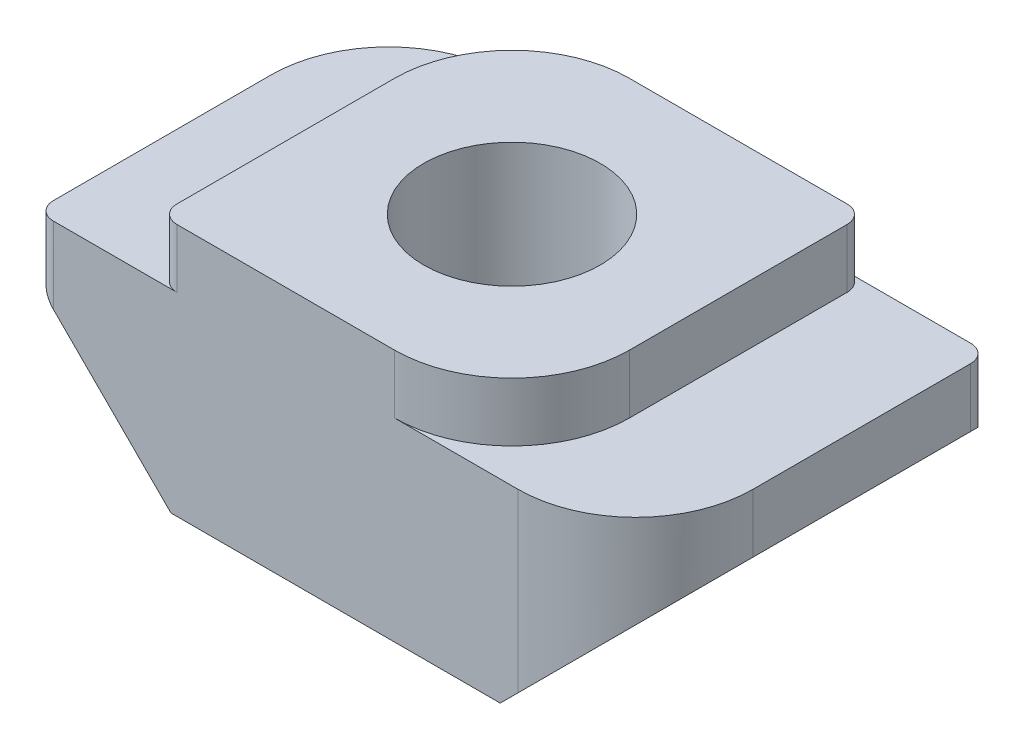
ISO-10303-21;
HEADER;
FILE_DESCRIPTION(('STEP AP214'),'2;1');
FILE_NAME('part.step','',(''),(''),'','','');
FILE_SCHEMA(('AUTOMOTIVE_DESIGN { 1 0 10303 214 1 1 1 1 }'));
ENDSEC;
DATA;
#1=APPLICATION_CONTEXT('core data for automotive mechanical design processes');
#2=APPLICATION_PROTOCOL_DEFINITION('international standard','automotive_design',2000,#1);
#3=PRODUCT_CONTEXT('',#1,'mechanical');
#4=PRODUCT('Part','Part','',(#3));
#5=PRODUCT_RELATED_PRODUCT_CATEGORY('part','',(#4));
#6=PRODUCT_DEFINITION_FORMATION('','',#4);
#7=PRODUCT_DEFINITION_CONTEXT('part definition',#1,'design');
#8=PRODUCT_DEFINITION('design','',#6,#7);
#9=PRODUCT_DEFINITION_SHAPE('','',#8);
#10=(LENGTH_UNIT() NAMED_UNIT(*) SI_UNIT(.MILLI.,.METRE.));
#11=(NAMED_UNIT(*) PLANE_ANGLE_UNIT() SI_UNIT($,.RADIAN.));
#12=(NAMED_UNIT(*) SI_UNIT($,.STERADIAN.) SOLID_ANGLE_UNIT());
#13=UNCERTAINTY_MEASURE_WITH_UNIT(LENGTH_MEASURE(1.E-05),#10,'distance_accuracy_value','');
#14=(GEOMETRIC_REPRESENTATION_CONTEXT(3) GLOBAL_UNCERTAINTY_ASSIGNED_CONTEXT((#13)) GLOBAL_UNIT_ASSIGNED_CONTEXT((#10,
#11,#12)) REPRESENTATION_CONTEXT('',''));
#15=CARTESIAN_POINT('',(0.,0.,0.));
#16=DIRECTION('',(0.,0.,1.));
#17=DIRECTION('',(1.,0.,0.));
#18=AXIS2_PLACEMENT_3D('',#15,#16,#17);
#19=CARTESIAN_POINT('',(3.,4.3,6.));
#20=DIRECTION('',(-1.,0.,0.));
#21=DIRECTION('',(0.,-1.,0.));
#22=AXIS2_PLACEMENT_3D('',#19,#20,#21);
#23=PLANE('',#22);
#24=DIRECTION('',(0.,0.,-1.));
#25=VECTOR('',#24,1.);
#26=CARTESIAN_POINT('',(3.,3.3,6.));
#27=LINE('',#26,#25);
#28=CARTESIAN_POINT('',(3.,3.3,4.));
#29=VERTEX_POINT('',#28);
#30=CARTESIAN_POINT('',(3.,3.3,0.3));
#31=VERTEX_POINT('',#30);
#32=EDGE_CURVE('E197',#29,#31,#27,.T.);
#33=ORIENTED_EDGE('',*,*,#32,.T.);
#34=DIRECTION('',(0.,1.,0.));
#35=VECTOR('',#34,1.);
#36=CARTESIAN_POINT('',(3.,4.3,0.3));
#37=LINE('',#36,#35);
#38=CARTESIAN_POINT('',(3.,4.3,0.3));
#39=VERTEX_POINT('',#38);
#40=EDGE_CURVE('E286',#31,#39,#37,.T.);
#41=ORIENTED_EDGE('',*,*,#40,.T.);
#42=DIRECTION('',(0.,0.,-1.));
#43=VECTOR('',#42,1.);
#44=CARTESIAN_POINT('',(3.,4.3,6.));
#45=LINE('',#44,#43);
#46=CARTESIAN_POINT('',(3.,4.3,4.));
#47=VERTEX_POINT('',#46);
#48=EDGE_CURVE('E226',#47,#39,#45,.T.);
#49=ORIENTED_EDGE('',*,*,#48,.F.);
#50=DIRECTION('',(0.,1.,0.));
#51=VECTOR('',#50,1.);
#52=CARTESIAN_POINT('',(3.,3.3,4.));
#53=LINE('',#52,#51);
#54=EDGE_CURVE('E237',#47,#29,#53,.F.);
#55=ORIENTED_EDGE('',*,*,#54,.T.);
#56=EDGE_LOOP('',(#33,#41,#49,#55));
#57=FACE_BOUND('',#56,.T.);
#58=ADVANCED_FACE('F36',(#57),#23,.F.);
#59=CARTESIAN_POINT('',(-3.,4.3,6.));
#60=DIRECTION('',(0.,-1.,0.));
#61=DIRECTION('',(0.,0.,-1.));
#62=AXIS2_PLACEMENT_3D('',#59,#60,#61);
#63=PLANE('',#62);
#64=CARTESIAN_POINT('',(0.,4.3,3.));
#65=DIRECTION('',(0.,1.,0.));
#66=DIRECTION('',(0.,0.,1.));
#67=AXIS2_PLACEMENT_3D('',#64,#65,#66);
#68=CIRCLE('',#67,1.5);
#69=CARTESIAN_POINT('',(0.,4.3,4.5));
#70=VERTEX_POINT('',#69);
#71=EDGE_CURVE('E320',#70,#70,#68,.T.);
#72=ORIENTED_EDGE('',*,*,#71,.F.);
#73=EDGE_LOOP('',(#72));
#74=FACE_BOUND('',#73,.T.);
#75=DIRECTION('',(0.,0.,-1.));
#76=VECTOR('',#75,1.);
#77=CARTESIAN_POINT('',(-3.,4.3,6.));
#78=LINE('',#77,#76);
#79=CARTESIAN_POINT('',(-3.,4.3,5.7));
#80=VERTEX_POINT('',#79);
#81=CARTESIAN_POINT('',(-3.,4.3,2.));
#82=VERTEX_POINT('',#81);
#83=EDGE_CURVE('E224',#80,#82,#78,.T.);
#84=ORIENTED_EDGE('',*,*,#83,.F.);
#85=CARTESIAN_POINT('',(-2.7,4.3,5.7));
#86=DIRECTION('',(0.,-1.,0.));
#87=DIRECTION('',(0.,0.,-1.));
#88=AXIS2_PLACEMENT_3D('',#85,#86,#87);
#89=CIRCLE('',#88,0.3);
#90=CARTESIAN_POINT('',(-2.7,4.3,6.));
#91=VERTEX_POINT('',#90);
#92=EDGE_CURVE('E284',#80,#91,#89,.F.);
#93=ORIENTED_EDGE('',*,*,#92,.T.);
#94=DIRECTION('',(-1.,0.,0.));
#95=VECTOR('',#94,1.);
#96=CARTESIAN_POINT('',(-3.,4.3,6.));
#97=LINE('',#96,#95);
#98=CARTESIAN_POINT('',(1.,4.3,6.));
#99=VERTEX_POINT('',#98);
#100=EDGE_CURVE('E210',#99,#91,#97,.T.);
#101=ORIENTED_EDGE('',*,*,#100,.F.);
#102=CARTESIAN_POINT('',(1.,4.3,4.));
#103=DIRECTION('',(0.,-1.,0.));
#104=DIRECTION('',(0.,0.,-1.));
#105=AXIS2_PLACEMENT_3D('',#102,#103,#104);
#106=CIRCLE('',#105,2.);
#107=EDGE_CURVE('E235',#99,#47,#106,.F.);
#108=ORIENTED_EDGE('',*,*,#107,.T.);
#109=ORIENTED_EDGE('',*,*,#48,.T.);
#110=CARTESIAN_POINT('',(2.7,4.3,0.3));
#111=DIRECTION('',(0.,-1.,0.));
#112=DIRECTION('',(0.,0.,-1.));
#113=AXIS2_PLACEMENT_3D('',#110,#111,#112);
#114=CIRCLE('',#113,0.3);
#115=CARTESIAN_POINT('',(2.7,4.3,0.));
#116=VERTEX_POINT('',#115);
#117=EDGE_CURVE('E282',#39,#116,#114,.F.);
#118=ORIENTED_EDGE('',*,*,#117,.T.);
#119=DIRECTION('',(-1.,0.,0.));
#120=VECTOR('',#119,1.);
#121=CARTESIAN_POINT('',(-3.,4.3,0.));
#122=LINE('',#121,#120);
#123=CARTESIAN_POINT('',(-1.,4.3,0.));
#124=VERTEX_POINT('',#123);
#125=EDGE_CURVE('E198',#116,#124,#122,.T.);
#126=ORIENTED_EDGE('',*,*,#125,.T.);
#127=CARTESIAN_POINT('',(-1.,4.3,2.));
#128=DIRECTION('',(0.,-1.,0.));
#129=DIRECTION('',(0.,0.,-1.));
#130=AXIS2_PLACEMENT_3D('',#127,#128,#129);
#131=CIRCLE('',#130,2.);
#132=EDGE_CURVE('E232',#124,#82,#131,.F.);
#133=ORIENTED_EDGE('',*,*,#132,.T.);
#134=EDGE_LOOP('',(#84,#93,#101,#108,#109,#118,#126,#133));
#135=FACE_BOUND('',#134,.T.);
#136=ADVANCED_FACE('F316',(#74,#135),#63,.F.);
#137=CARTESIAN_POINT('',(-3.,4.3,6.));
#138=DIRECTION('',(1.,0.,0.));
#139=DIRECTION('',(0.,1.,0.));
#140=AXIS2_PLACEMENT_3D('',#137,#138,#139);
#141=PLANE('',#140);
#142=DIRECTION('',(0.,0.,-1.));
#143=VECTOR('',#142,1.);
#144=CARTESIAN_POINT('',(-3.,3.3,6.));
#145=LINE('',#144,#143);
#146=CARTESIAN_POINT('',(-3.,3.3,5.7));
#147=VERTEX_POINT('',#146);
#148=CARTESIAN_POINT('',(-3.,3.3,2.));
#149=VERTEX_POINT('',#148);
#150=EDGE_CURVE('E222',#147,#149,#145,.T.);
#151=ORIENTED_EDGE('',*,*,#150,.F.);
#152=DIRECTION('',(0.,-1.,0.));
#153=VECTOR('',#152,1.);
#154=CARTESIAN_POINT('',(-3.,4.3,5.7));
#155=LINE('',#154,#153);
#156=EDGE_CURVE('E280',#147,#80,#155,.F.);
#157=ORIENTED_EDGE('',*,*,#156,.T.);
#158=ORIENTED_EDGE('',*,*,#83,.T.);
#159=DIRECTION('',(0.,-1.,0.));
#160=VECTOR('',#159,1.);
#161=CARTESIAN_POINT('',(-3.,4.3,2.));
#162=LINE('',#161,#160);
#163=EDGE_CURVE('E239',#82,#149,#162,.T.);
#164=ORIENTED_EDGE('',*,*,#163,.T.);
#165=EDGE_LOOP('',(#151,#157,#158,#164));
#166=FACE_BOUND('',#165,.T.);
#167=ADVANCED_FACE('F308',(#166),#141,.F.);
#168=CARTESIAN_POINT('',(-3.,3.3,6.));
#169=DIRECTION('',(0.,-1.,0.));
#170=DIRECTION('',(0.,0.,-1.));
#171=AXIS2_PLACEMENT_3D('',#168,#169,#170);
#172=PLANE('',#171);
#173=DIRECTION('',(0.,0.,-1.));
#174=VECTOR('',#173,1.);
#175=CARTESIAN_POINT('',(-5.1,3.3,6.));
#176=LINE('',#175,#174);
#177=CARTESIAN_POINT('',(-5.1,3.3,5.7));
#178=VERTEX_POINT('',#177);
#179=CARTESIAN_POINT('',(-5.1,3.3,2.));
#180=VERTEX_POINT('',#179);
#181=EDGE_CURVE('E220',#178,#180,#176,.T.);
#182=ORIENTED_EDGE('',*,*,#181,.F.);
#183=CARTESIAN_POINT('',(-4.8,3.3,5.7));
#184=DIRECTION('',(0.,-1.,0.));
#185=DIRECTION('',(0.,0.,-1.));
#186=AXIS2_PLACEMENT_3D('',#183,#184,#185);
#187=CIRCLE('',#186,0.3);
#188=CARTESIAN_POINT('',(-4.8,3.3,6.));
#189=VERTEX_POINT('',#188);
#190=EDGE_CURVE('E278',#178,#189,#187,.F.);
#191=ORIENTED_EDGE('',*,*,#190,.T.);
#192=DIRECTION('',(-1.,0.,0.));
#193=VECTOR('',#192,1.);
#194=CARTESIAN_POINT('',(-3.,3.3,6.));
#195=LINE('',#194,#193);
#196=CARTESIAN_POINT('',(-2.7,3.3,6.));
#197=VERTEX_POINT('',#196);
#198=EDGE_CURVE('E175',#197,#189,#195,.T.);
#199=ORIENTED_EDGE('',*,*,#198,.F.);
#200=CARTESIAN_POINT('',(-2.7,3.3,5.7));
#201=DIRECTION('',(0.,-1.,0.));
#202=DIRECTION('',(0.,0.,-1.));
#203=AXIS2_PLACEMENT_3D('',#200,#201,#202);
#204=CIRCLE('',#203,0.3);
#205=EDGE_CURVE('E45',#197,#147,#204,.T.);
#206=ORIENTED_EDGE('',*,*,#205,.T.);
#207=ORIENTED_EDGE('',*,*,#150,.T.);
#208=CARTESIAN_POINT('',(-1.,3.3,2.));
#209=DIRECTION('',(0.,-1.,0.));
#210=DIRECTION('',(0.,0.,-1.));
#211=AXIS2_PLACEMENT_3D('',#208,#209,#210);
#212=CIRCLE('',#211,2.);
#213=CARTESIAN_POINT('',(-1.,3.3,0.));
#214=VERTEX_POINT('',#213);
#215=EDGE_CURVE('E248',#149,#214,#212,.T.);
#216=ORIENTED_EDGE('',*,*,#215,.T.);
#217=DIRECTION('',(-1.,0.,0.));
#218=VECTOR('',#217,1.);
#219=CARTESIAN_POINT('',(-3.,3.3,0.));
#220=LINE('',#219,#218);
#221=CARTESIAN_POINT('',(-3.1,3.3,0.));
#222=VERTEX_POINT('',#221);
#223=EDGE_CURVE('E200',#214,#222,#220,.T.);
#224=ORIENTED_EDGE('',*,*,#223,.T.);
#225=CARTESIAN_POINT('',(-3.1,3.3,2.));
#226=DIRECTION('',(0.,-1.,0.));
#227=DIRECTION('',(0.,0.,-1.));
#228=AXIS2_PLACEMENT_3D('',#225,#226,#227);
#229=CIRCLE('',#228,2.);
#230=EDGE_CURVE('E267',#222,#180,#229,.F.);
#231=ORIENTED_EDGE('',*,*,#230,.T.);
#232=EDGE_LOOP('',(#182,#191,#199,#206,#207,#216,#224,#231));
#233=FACE_BOUND('',#232,.T.);
#234=ADVANCED_FACE('F302',(#233),#172,.F.);
#235=CARTESIAN_POINT('',(-5.1,3.3,6.));
#236=DIRECTION('',(1.,0.,0.));
#237=DIRECTION('',(0.,0.,-1.));
#238=AXIS2_PLACEMENT_3D('',#235,#236,#237);
#239=PLANE('',#238);
#240=DIRECTION('',(0.,0.,-1.));
#241=VECTOR('',#240,1.);
#242=CARTESIAN_POINT('',(-5.1,2.3,6.));
#243=LINE('',#242,#241);
#244=CARTESIAN_POINT('',(-5.1,2.3,5.7));
#245=VERTEX_POINT('',#244);
#246=CARTESIAN_POINT('',(-5.1,2.3,2.));
#247=VERTEX_POINT('',#246);
#248=EDGE_CURVE('E184',#245,#247,#243,.T.);
#249=ORIENTED_EDGE('',*,*,#248,.F.);
#250=DIRECTION('',(0.,-1.,0.));
#251=VECTOR('',#250,1.);
#252=CARTESIAN_POINT('',(-5.1,3.3,5.7));
#253=LINE('',#252,#251);
#254=EDGE_CURVE('E276',#245,#178,#253,.F.);
#255=ORIENTED_EDGE('',*,*,#254,.T.);
#256=ORIENTED_EDGE('',*,*,#181,.T.);
#257=DIRECTION('',(0.,-1.,0.));
#258=VECTOR('',#257,1.);
#259=CARTESIAN_POINT('',(-5.1,3.3,2.));
#260=LINE('',#259,#258);
#261=EDGE_CURVE('E260',#180,#247,#260,.T.);
#262=ORIENTED_EDGE('',*,*,#261,.T.);
#263=EDGE_LOOP('',(#249,#255,#256,#262));
#264=FACE_BOUND('',#263,.T.);
#265=ADVANCED_FACE('F401',(#264),#239,.F.);
#266=CARTESIAN_POINT('',(-5.1,2.3,6.));
#267=DIRECTION('',(0.707106781186551,0.707106781186544,0.));
#268=DIRECTION('',(-0.707106781186544,0.707106781186551,0.));
#269=AXIS2_PLACEMENT_3D('',#266,#267,#268);
#270=PLANE('',#269);
#271=DIRECTION('',(0.707106781186544,-0.707106781186551,0.));
#272=VECTOR('',#271,1.);
#273=CARTESIAN_POINT('',(-5.1,2.3,6.));
#274=LINE('',#273,#272);
#275=CARTESIAN_POINT('',(-4.8,2.,6.));
#276=VERTEX_POINT('',#275);
#277=CARTESIAN_POINT('',(-2.80000000000002,0.,6.));
#278=VERTEX_POINT('',#277);
#279=EDGE_CURVE('E164',#276,#278,#274,.T.);
#280=ORIENTED_EDGE('',*,*,#279,.F.);
#281=CARTESIAN_POINT('',(-4.8,2.,5.7));
#282=DIRECTION('',(0.707106781186551,0.707106781186544,0.));
#283=DIRECTION('',(-0.707106781186544,0.707106781186551,0.));
#284=AXIS2_PLACEMENT_3D('',#281,#282,#283);
#285=ELLIPSE('',#284,0.424264068711931,0.3);
#286=EDGE_CURVE('E274',#276,#245,#285,.F.);
#287=ORIENTED_EDGE('',*,*,#286,.T.);
#288=ORIENTED_EDGE('',*,*,#248,.T.);
#289=CARTESIAN_POINT('',(-3.1,0.299999999999978,2.));
#290=DIRECTION('',(0.707106781186551,0.707106781186544,0.));
#291=DIRECTION('',(0.707106781186544,-0.707106781186551,0.));
#292=AXIS2_PLACEMENT_3D('',#289,#290,#291);
#293=ELLIPSE('',#292,2.82842712474621,2.);
#294=CARTESIAN_POINT('',(-3.1,0.299999999999978,0.));
#295=VERTEX_POINT('',#294);
#296=EDGE_CURVE('E263',#247,#295,#293,.F.);
#297=ORIENTED_EDGE('',*,*,#296,.T.);
#298=DIRECTION('',(0.707106781186544,-0.707106781186551,0.));
#299=VECTOR('',#298,1.);
#300=CARTESIAN_POINT('',(-5.1,2.3,0.));
#301=LINE('',#300,#299);
#302=CARTESIAN_POINT('',(-2.80000000000002,0.,0.));
#303=VERTEX_POINT('',#302);
#304=EDGE_CURVE('E181',#295,#303,#301,.T.);
#305=ORIENTED_EDGE('',*,*,#304,.T.);
#306=DIRECTION('',(0.,0.,-1.));
#307=VECTOR('',#306,1.);
#308=CARTESIAN_POINT('',(-2.80000000000002,0.,6.));
#309=LINE('',#308,#307);
#310=EDGE_CURVE('E178',#278,#303,#309,.T.);
#311=ORIENTED_EDGE('',*,*,#310,.F.);
#312=EDGE_LOOP('',(#280,#287,#288,#297,#305,#311));
#313=FACE_BOUND('',#312,.T.);
#314=ADVANCED_FACE('F179',(#313),#270,.F.);
#315=CARTESIAN_POINT('',(2.80000000000002,0.,6.));
#316=DIRECTION('',(0.,1.,0.));
#317=DIRECTION('',(0.,0.,1.));
#318=AXIS2_PLACEMENT_3D('',#315,#316,#317);
#319=PLANE('',#318);
#320=CARTESIAN_POINT('',(0.,0.,3.));
#321=DIRECTION('',(0.,1.,0.));
#322=DIRECTION('',(0.,0.,1.));
#323=AXIS2_PLACEMENT_3D('',#320,#321,#322);
#324=CIRCLE('',#323,1.5);
#325=CARTESIAN_POINT('',(0.,0.,4.5));
#326=VERTEX_POINT('',#325);
#327=EDGE_CURVE('E40',#326,#326,#324,.T.);
#328=ORIENTED_EDGE('',*,*,#327,.T.);
#329=EDGE_LOOP('',(#328));
#330=FACE_BOUND('',#329,.T.);
#331=DIRECTION('',(1.,0.,0.));
#332=VECTOR('',#331,1.);
#333=CARTESIAN_POINT('',(2.80000000000002,0.,0.));
#334=LINE('',#333,#332);
#335=CARTESIAN_POINT('',(2.80000000000002,0.,0.));
#336=VERTEX_POINT('',#335);
#337=EDGE_CURVE('E204',#303,#336,#334,.T.);
#338=ORIENTED_EDGE('',*,*,#337,.T.);
#339=DIRECTION('',(0.,0.,-1.));
#340=VECTOR('',#339,1.);
#341=CARTESIAN_POINT('',(2.80000000000002,0.,6.));
#342=LINE('',#341,#340);
#343=CARTESIAN_POINT('',(2.80000000000002,0.,6.));
#344=VERTEX_POINT('',#343);
#345=EDGE_CURVE('E185',#344,#336,#342,.T.);
#346=ORIENTED_EDGE('',*,*,#345,.F.);
#347=DIRECTION('',(1.,0.,0.));
#348=VECTOR('',#347,1.);
#349=CARTESIAN_POINT('',(2.80000000000002,0.,6.));
#350=LINE('',#349,#348);
#351=EDGE_CURVE('E170',#278,#344,#350,.T.);
#352=ORIENTED_EDGE('',*,*,#351,.F.);
#353=ORIENTED_EDGE('',*,*,#310,.T.);
#354=EDGE_LOOP('',(#338,#346,#352,#353));
#355=FACE_BOUND('',#354,.T.);
#356=ADVANCED_FACE('F187',(#330,#355),#319,.F.);
#357=CARTESIAN_POINT('',(5.1,2.3,6.));
#358=DIRECTION('',(-0.707106781186551,0.707106781186544,0.));
#359=DIRECTION('',(-0.707106781186544,-0.707106781186551,0.));
#360=AXIS2_PLACEMENT_3D('',#357,#358,#359);
#361=PLANE('',#360);
#362=DIRECTION('',(0.707106781186544,0.707106781186551,0.));
#363=VECTOR('',#362,1.);
#364=CARTESIAN_POINT('',(5.1,2.3,0.));
#365=LINE('',#364,#363);
#366=CARTESIAN_POINT('',(4.8,2.,0.));
#367=VERTEX_POINT('',#366);
#368=EDGE_CURVE('E206',#336,#367,#365,.T.);
#369=ORIENTED_EDGE('',*,*,#368,.T.);
#370=CARTESIAN_POINT('',(4.8,2.,0.3));
#371=DIRECTION('',(-0.707106781186551,0.707106781186544,0.));
#372=DIRECTION('',(0.707106781186544,0.707106781186551,0.));
#373=AXIS2_PLACEMENT_3D('',#370,#371,#372);
#374=ELLIPSE('',#373,0.424264068711931,0.3);
#375=CARTESIAN_POINT('',(5.1,2.3,0.3));
#376=VERTEX_POINT('',#375);
#377=EDGE_CURVE('E52',#367,#376,#374,.F.);
#378=ORIENTED_EDGE('',*,*,#377,.T.);
#379=DIRECTION('',(0.,0.,-1.));
#380=VECTOR('',#379,1.);
#381=CARTESIAN_POINT('',(5.1,2.3,6.));
#382=LINE('',#381,#380);
#383=CARTESIAN_POINT('',(5.1,2.3,4.));
#384=VERTEX_POINT('',#383);
#385=EDGE_CURVE('E216',#384,#376,#382,.T.);
#386=ORIENTED_EDGE('',*,*,#385,.F.);
#387=CARTESIAN_POINT('',(3.1,0.299999999999978,4.));
#388=DIRECTION('',(-0.707106781186551,0.707106781186544,0.));
#389=DIRECTION('',(-0.707106781186544,-0.707106781186551,0.));
#390=AXIS2_PLACEMENT_3D('',#387,#388,#389);
#391=ELLIPSE('',#390,2.82842712474621,2.);
#392=CARTESIAN_POINT('',(3.1,0.299999999999978,6.));
#393=VERTEX_POINT('',#392);
#394=EDGE_CURVE('E258',#384,#393,#391,.F.);
#395=ORIENTED_EDGE('',*,*,#394,.T.);
#396=DIRECTION('',(0.707106781186544,0.707106781186551,0.));
#397=VECTOR('',#396,1.);
#398=CARTESIAN_POINT('',(5.1,2.3,6.));
#399=LINE('',#398,#397);
#400=EDGE_CURVE('E190',#344,#393,#399,.T.);
#401=ORIENTED_EDGE('',*,*,#400,.F.);
#402=ORIENTED_EDGE('',*,*,#345,.T.);
#403=EDGE_LOOP('',(#369,#378,#386,#395,#401,#402));
#404=FACE_BOUND('',#403,.T.);
#405=ADVANCED_FACE('F389',(#404),#361,.F.);
#406=CARTESIAN_POINT('',(5.1,3.3,6.));
#407=DIRECTION('',(-1.,0.,0.));
#408=DIRECTION('',(0.,0.,1.));
#409=AXIS2_PLACEMENT_3D('',#406,#407,#408);
#410=PLANE('',#409);
#411=ORIENTED_EDGE('',*,*,#385,.T.);
#412=DIRECTION('',(0.,1.,0.));
#413=VECTOR('',#412,1.);
#414=CARTESIAN_POINT('',(5.1,3.3,0.3));
#415=LINE('',#414,#413);
#416=CARTESIAN_POINT('',(5.1,3.3,0.3));
#417=VERTEX_POINT('',#416);
#418=EDGE_CURVE('E294',#376,#417,#415,.T.);
#419=ORIENTED_EDGE('',*,*,#418,.T.);
#420=DIRECTION('',(0.,0.,-1.));
#421=VECTOR('',#420,1.);
#422=CARTESIAN_POINT('',(5.1,3.3,6.));
#423=LINE('',#422,#421);
#424=CARTESIAN_POINT('',(5.1,3.3,4.));
#425=VERTEX_POINT('',#424);
#426=EDGE_CURVE('E213',#425,#417,#423,.T.);
#427=ORIENTED_EDGE('',*,*,#426,.F.);
#428=DIRECTION('',(0.,1.,0.));
#429=VECTOR('',#428,1.);
#430=CARTESIAN_POINT('',(5.1,2.3,4.));
#431=LINE('',#430,#429);
#432=EDGE_CURVE('E256',#425,#384,#431,.F.);
#433=ORIENTED_EDGE('',*,*,#432,.T.);
#434=EDGE_LOOP('',(#411,#419,#427,#433));
#435=FACE_BOUND('',#434,.T.);
#436=ADVANCED_FACE('F388',(#435),#410,.F.);
#437=CARTESIAN_POINT('',(3.,3.3,6.));
#438=DIRECTION('',(0.,-1.,0.));
#439=DIRECTION('',(0.,0.,-1.));
#440=AXIS2_PLACEMENT_3D('',#437,#438,#439);
#441=PLANE('',#440);
#442=ORIENTED_EDGE('',*,*,#426,.T.);
#443=CARTESIAN_POINT('',(4.8,3.3,0.3));
#444=DIRECTION('',(0.,-1.,0.));
#445=DIRECTION('',(0.,0.,-1.));
#446=AXIS2_PLACEMENT_3D('',#443,#444,#445);
#447=CIRCLE('',#446,0.3);
#448=CARTESIAN_POINT('',(4.8,3.3,0.));
#449=VERTEX_POINT('',#448);
#450=EDGE_CURVE('E60',#417,#449,#447,.F.);
#451=ORIENTED_EDGE('',*,*,#450,.T.);
#452=DIRECTION('',(-1.,0.,0.));
#453=VECTOR('',#452,1.);
#454=CARTESIAN_POINT('',(3.,3.3,0.));
#455=LINE('',#454,#453);
#456=CARTESIAN_POINT('',(2.7,3.3,0.));
#457=VERTEX_POINT('',#456);
#458=EDGE_CURVE('E208',#449,#457,#455,.T.);
#459=ORIENTED_EDGE('',*,*,#458,.T.);
#460=CARTESIAN_POINT('',(2.7,3.3,0.3));
#461=DIRECTION('',(0.,-1.,0.));
#462=DIRECTION('',(0.,0.,-1.));
#463=AXIS2_PLACEMENT_3D('',#460,#461,#462);
#464=CIRCLE('',#463,0.3);
#465=EDGE_CURVE('E11',#457,#31,#464,.T.);
#466=ORIENTED_EDGE('',*,*,#465,.T.);
#467=ORIENTED_EDGE('',*,*,#32,.F.);
#468=CARTESIAN_POINT('',(1.,3.3,4.));
#469=DIRECTION('',(0.,-1.,0.));
#470=DIRECTION('',(0.,0.,-1.));
#471=AXIS2_PLACEMENT_3D('',#468,#469,#470);
#472=CIRCLE('',#471,2.);
#473=CARTESIAN_POINT('',(1.,3.3,6.));
#474=VERTEX_POINT('',#473);
#475=EDGE_CURVE('E245',#29,#474,#472,.T.);
#476=ORIENTED_EDGE('',*,*,#475,.T.);
#477=DIRECTION('',(-1.,0.,0.));
#478=VECTOR('',#477,1.);
#479=CARTESIAN_POINT('',(3.,3.3,6.));
#480=LINE('',#479,#478);
#481=CARTESIAN_POINT('',(3.1,3.3,6.));
#482=VERTEX_POINT('',#481);
#483=EDGE_CURVE('E192',#482,#474,#480,.T.);
#484=ORIENTED_EDGE('',*,*,#483,.F.);
#485=CARTESIAN_POINT('',(3.1,3.3,4.));
#486=DIRECTION('',(0.,-1.,0.));
#487=DIRECTION('',(0.,0.,-1.));
#488=AXIS2_PLACEMENT_3D('',#485,#486,#487);
#489=CIRCLE('',#488,2.);
#490=EDGE_CURVE('E254',#482,#425,#489,.F.);
#491=ORIENTED_EDGE('',*,*,#490,.T.);
#492=EDGE_LOOP('',(#442,#451,#459,#466,#467,#476,#484,#491));
#493=FACE_BOUND('',#492,.T.);
#494=ADVANCED_FACE('F377',(#493),#441,.F.);
#495=CARTESIAN_POINT('',(0.,0.,6.));
#496=DIRECTION('',(0.,0.,1.));
#497=DIRECTION('',(1.,0.,0.));
#498=AXIS2_PLACEMENT_3D('',#495,#496,#497);
#499=PLANE('',#498);
#500=ORIENTED_EDGE('',*,*,#198,.T.);
#501=DIRECTION('',(0.,-1.,0.));
#502=VECTOR('',#501,1.);
#503=CARTESIAN_POINT('',(-4.8,2.3,6.));
#504=LINE('',#503,#502);
#505=EDGE_CURVE('E173',#189,#276,#504,.T.);
#506=ORIENTED_EDGE('',*,*,#505,.T.);
#507=ORIENTED_EDGE('',*,*,#279,.T.);
#508=ORIENTED_EDGE('',*,*,#351,.T.);
#509=ORIENTED_EDGE('',*,*,#400,.T.);
#510=DIRECTION('',(0.,1.,0.));
#511=VECTOR('',#510,1.);
#512=CARTESIAN_POINT('',(3.1,3.3,6.));
#513=LINE('',#512,#511);
#514=EDGE_CURVE('E251',#393,#482,#513,.T.);
#515=ORIENTED_EDGE('',*,*,#514,.T.);
#516=ORIENTED_EDGE('',*,*,#483,.T.);
#517=DIRECTION('',(0.,1.,0.));
#518=VECTOR('',#517,1.);
#519=CARTESIAN_POINT('',(1.,4.3,6.));
#520=LINE('',#519,#518);
#521=EDGE_CURVE('E229',#474,#99,#520,.T.);
#522=ORIENTED_EDGE('',*,*,#521,.T.);
#523=ORIENTED_EDGE('',*,*,#100,.T.);
#524=DIRECTION('',(0.,-1.,0.));
#525=VECTOR('',#524,1.);
#526=CARTESIAN_POINT('',(-2.7,3.3,6.));
#527=LINE('',#526,#525);
#528=EDGE_CURVE('E270',#91,#197,#527,.T.);
#529=ORIENTED_EDGE('',*,*,#528,.T.);
#530=EDGE_LOOP('',(#500,#506,#507,#508,#509,#515,#516,#522,#523,#529));
#531=FACE_BOUND('',#530,.T.);
#532=ADVANCED_FACE('F167',(#531),#499,.T.);
#533=CARTESIAN_POINT('',(0.,0.,0.));
#534=DIRECTION('',(0.,0.,1.));
#535=DIRECTION('',(1.,0.,0.));
#536=AXIS2_PLACEMENT_3D('',#533,#534,#535);
#537=PLANE('',#536);
#538=ORIENTED_EDGE('',*,*,#125,.F.);
#539=DIRECTION('',(0.,1.,0.));
#540=VECTOR('',#539,1.);
#541=CARTESIAN_POINT('',(2.7,0.,0.));
#542=LINE('',#541,#540);
#543=EDGE_CURVE('E291',#116,#457,#542,.F.);
#544=ORIENTED_EDGE('',*,*,#543,.T.);
#545=ORIENTED_EDGE('',*,*,#458,.F.);
#546=DIRECTION('',(0.,1.,0.));
#547=VECTOR('',#546,1.);
#548=CARTESIAN_POINT('',(4.8,0.,0.));
#549=LINE('',#548,#547);
#550=EDGE_CURVE('E289',#449,#367,#549,.F.);
#551=ORIENTED_EDGE('',*,*,#550,.T.);
#552=ORIENTED_EDGE('',*,*,#368,.F.);
#553=ORIENTED_EDGE('',*,*,#337,.F.);
#554=ORIENTED_EDGE('',*,*,#304,.F.);
#555=DIRECTION('',(0.,-1.,0.));
#556=VECTOR('',#555,1.);
#557=CARTESIAN_POINT('',(-3.1,0.,0.));
#558=LINE('',#557,#556);
#559=EDGE_CURVE('E265',#295,#222,#558,.F.);
#560=ORIENTED_EDGE('',*,*,#559,.T.);
#561=ORIENTED_EDGE('',*,*,#223,.F.);
#562=DIRECTION('',(0.,-1.,0.));
#563=VECTOR('',#562,1.);
#564=CARTESIAN_POINT('',(-1.,0.,0.));
#565=LINE('',#564,#563);
#566=EDGE_CURVE('E242',#214,#124,#565,.F.);
#567=ORIENTED_EDGE('',*,*,#566,.T.);
#568=EDGE_LOOP('',(#538,#544,#545,#551,#552,#553,#554,#560,#561,#567));
#569=FACE_BOUND('',#568,.T.);
#570=ADVANCED_FACE('F350',(#569),#537,.F.);
#571=CARTESIAN_POINT('',(1.,0.,4.));
#572=DIRECTION('',(0.,-1.,0.));
#573=DIRECTION('',(1.,0.,0.));
#574=AXIS2_PLACEMENT_3D('',#571,#572,#573);
#575=CYLINDRICAL_SURFACE('',#574,2.);
#576=ORIENTED_EDGE('',*,*,#475,.F.);
#577=ORIENTED_EDGE('',*,*,#54,.F.);
#578=ORIENTED_EDGE('',*,*,#107,.F.);
#579=ORIENTED_EDGE('',*,*,#521,.F.);
#580=EDGE_LOOP('',(#576,#577,#578,#579));
#581=FACE_BOUND('',#580,.T.);
#582=ADVANCED_FACE('F346',(#581),#575,.T.);
#583=CARTESIAN_POINT('',(-1.,4.3,2.));
#584=DIRECTION('',(0.,-1.,0.));
#585=DIRECTION('',(1.,0.,0.));
#586=AXIS2_PLACEMENT_3D('',#583,#584,#585);
#587=CYLINDRICAL_SURFACE('',#586,2.);
#588=ORIENTED_EDGE('',*,*,#132,.F.);
#589=ORIENTED_EDGE('',*,*,#566,.F.);
#590=ORIENTED_EDGE('',*,*,#215,.F.);
#591=ORIENTED_EDGE('',*,*,#163,.F.);
#592=EDGE_LOOP('',(#588,#589,#590,#591));
#593=FACE_BOUND('',#592,.T.);
#594=ADVANCED_FACE('F349',(#593),#587,.T.);
#595=CARTESIAN_POINT('',(3.1,0.,4.));
#596=DIRECTION('',(0.,-1.,0.));
#597=DIRECTION('',(0.,0.,-1.));
#598=AXIS2_PLACEMENT_3D('',#595,#596,#597);
#599=CYLINDRICAL_SURFACE('',#598,2.);
#600=ORIENTED_EDGE('',*,*,#394,.F.);
#601=ORIENTED_EDGE('',*,*,#432,.F.);
#602=ORIENTED_EDGE('',*,*,#490,.F.);
#603=ORIENTED_EDGE('',*,*,#514,.F.);
#604=EDGE_LOOP('',(#600,#601,#602,#603));
#605=FACE_BOUND('',#604,.T.);
#606=ADVANCED_FACE('F354',(#605),#599,.T.);
#607=CARTESIAN_POINT('',(-3.1,3.3,2.));
#608=DIRECTION('',(0.,-1.,0.));
#609=DIRECTION('',(0.,0.,-1.));
#610=AXIS2_PLACEMENT_3D('',#607,#608,#609);
#611=CYLINDRICAL_SURFACE('',#610,2.);
#612=ORIENTED_EDGE('',*,*,#230,.F.);
#613=ORIENTED_EDGE('',*,*,#559,.F.);
#614=ORIENTED_EDGE('',*,*,#296,.F.);
#615=ORIENTED_EDGE('',*,*,#261,.F.);
#616=EDGE_LOOP('',(#612,#613,#614,#615));
#617=FACE_BOUND('',#616,.T.);
#618=ADVANCED_FACE('F358',(#617),#611,.T.);
#619=CARTESIAN_POINT('',(-4.8,0.,5.7));
#620=DIRECTION('',(0.,1.,0.));
#621=DIRECTION('',(0.,0.,1.));
#622=AXIS2_PLACEMENT_3D('',#619,#620,#621);
#623=CYLINDRICAL_SURFACE('',#622,0.3);
#624=ORIENTED_EDGE('',*,*,#190,.F.);
#625=ORIENTED_EDGE('',*,*,#254,.F.);
#626=ORIENTED_EDGE('',*,*,#286,.F.);
#627=ORIENTED_EDGE('',*,*,#505,.F.);
#628=EDGE_LOOP('',(#624,#625,#626,#627));
#629=FACE_BOUND('',#628,.T.);
#630=ADVANCED_FACE('F362',(#629),#623,.T.);
#631=CARTESIAN_POINT('',(-2.7,0.,5.7));
#632=DIRECTION('',(0.,1.,0.));
#633=DIRECTION('',(-1.,0.,0.));
#634=AXIS2_PLACEMENT_3D('',#631,#632,#633);
#635=CYLINDRICAL_SURFACE('',#634,0.3);
#636=ORIENTED_EDGE('',*,*,#92,.F.);
#637=ORIENTED_EDGE('',*,*,#156,.F.);
#638=ORIENTED_EDGE('',*,*,#205,.F.);
#639=ORIENTED_EDGE('',*,*,#528,.F.);
#640=EDGE_LOOP('',(#636,#637,#638,#639));
#641=FACE_BOUND('',#640,.T.);
#642=ADVANCED_FACE('F312',(#641),#635,.T.);
#643=CARTESIAN_POINT('',(2.7,4.3,0.3));
#644=DIRECTION('',(0.,1.,0.));
#645=DIRECTION('',(-1.,0.,0.));
#646=AXIS2_PLACEMENT_3D('',#643,#644,#645);
#647=CYLINDRICAL_SURFACE('',#646,0.3);
#648=ORIENTED_EDGE('',*,*,#465,.F.);
#649=ORIENTED_EDGE('',*,*,#543,.F.);
#650=ORIENTED_EDGE('',*,*,#117,.F.);
#651=ORIENTED_EDGE('',*,*,#40,.F.);
#652=EDGE_LOOP('',(#648,#649,#650,#651));
#653=FACE_BOUND('',#652,.T.);
#654=ADVANCED_FACE('F334',(#653),#647,.T.);
#655=CARTESIAN_POINT('',(4.8,3.3,0.3));
#656=DIRECTION('',(0.,1.,0.));
#657=DIRECTION('',(0.,0.,1.));
#658=AXIS2_PLACEMENT_3D('',#655,#656,#657);
#659=CYLINDRICAL_SURFACE('',#658,0.3);
#660=ORIENTED_EDGE('',*,*,#377,.F.);
#661=ORIENTED_EDGE('',*,*,#550,.F.);
#662=ORIENTED_EDGE('',*,*,#450,.F.);
#663=ORIENTED_EDGE('',*,*,#418,.F.);
#664=EDGE_LOOP('',(#660,#661,#662,#663));
#665=FACE_BOUND('',#664,.T.);
#666=ADVANCED_FACE('F38',(#665),#659,.T.);
#667=CARTESIAN_POINT('',(0.,-1.7,3.));
#668=DIRECTION('',(0.,1.,0.));
#669=DIRECTION('',(0.,0.,1.));
#670=AXIS2_PLACEMENT_3D('',#667,#668,#669);
#671=CYLINDRICAL_SURFACE('',#670,1.5);
#672=ORIENTED_EDGE('',*,*,#71,.T.);
#673=EDGE_LOOP('',(#672));
#674=FACE_BOUND('',#673,.T.);
#675=ORIENTED_EDGE('',*,*,#327,.F.);
#676=EDGE_LOOP('',(#675));
#677=FACE_BOUND('',#676,.T.);
#678=ADVANCED_FACE('F328',(#674,#677),#671,.F.);
#679=CLOSED_SHELL('',(#58,#136,#167,#234,#265,#314,#356,#405,#436,#494,#532,#570,#582,#594,#606,
#618,#630,#642,#654,#666,#678));
#680=MANIFOLD_SOLID_BREP('B2',#679);
#681=ADVANCED_BREP_SHAPE_REPRESENTATION('',(#18,#680),#14);
#682=SHAPE_DEFINITION_REPRESENTATION(#9,#681);
ENDSEC;
END-ISO-10303-21;
